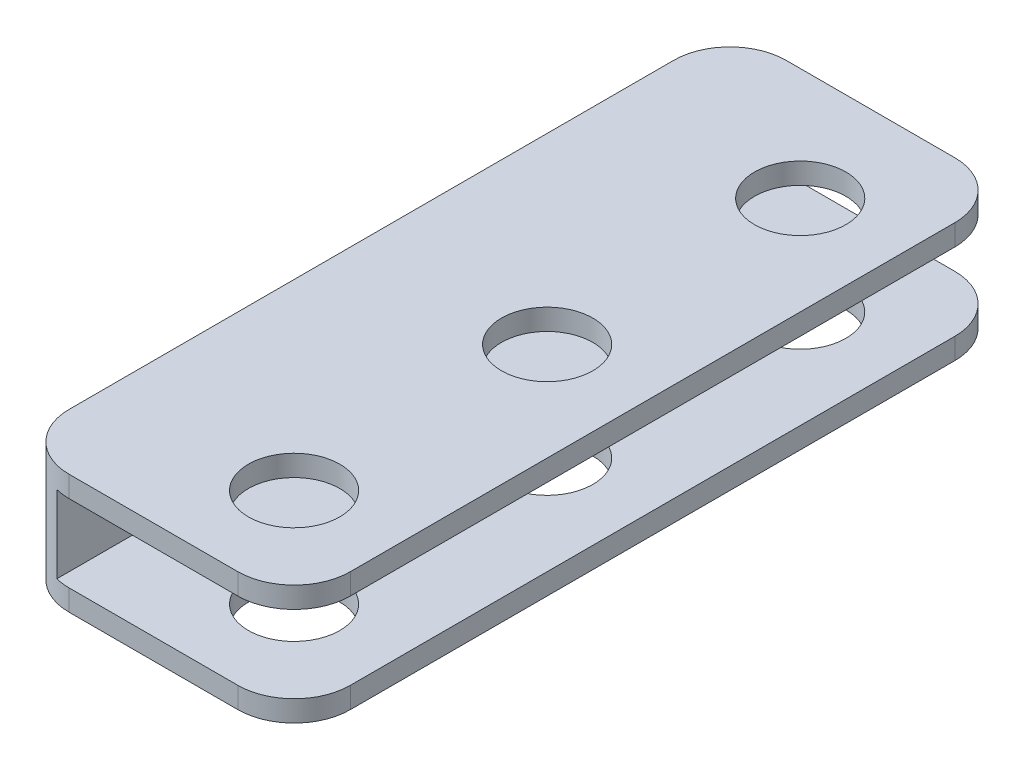
ISO-10303-21;
HEADER;
FILE_DESCRIPTION(('STEP AP214'),'2;1');
FILE_NAME('part.step','',(''),(''),'','','');
FILE_SCHEMA(('AUTOMOTIVE_DESIGN { 1 0 10303 214 1 1 1 1 }'));
ENDSEC;
DATA;
#1=APPLICATION_CONTEXT('core data for automotive mechanical design processes');
#2=APPLICATION_PROTOCOL_DEFINITION('international standard','automotive_design',2000,#1);
#3=PRODUCT_CONTEXT('',#1,'mechanical');
#4=PRODUCT('Part','Part','',(#3));
#5=PRODUCT_RELATED_PRODUCT_CATEGORY('part','',(#4));
#6=PRODUCT_DEFINITION_FORMATION('','',#4);
#7=PRODUCT_DEFINITION_CONTEXT('part definition',#1,'design');
#8=PRODUCT_DEFINITION('design','',#6,#7);
#9=PRODUCT_DEFINITION_SHAPE('','',#8);
#10=(LENGTH_UNIT() NAMED_UNIT(*) SI_UNIT(.MILLI.,.METRE.));
#11=(NAMED_UNIT(*) PLANE_ANGLE_UNIT() SI_UNIT($,.RADIAN.));
#12=(NAMED_UNIT(*) SI_UNIT($,.STERADIAN.) SOLID_ANGLE_UNIT());
#13=UNCERTAINTY_MEASURE_WITH_UNIT(LENGTH_MEASURE(1.E-05),#10,'distance_accuracy_value','');
#14=(GEOMETRIC_REPRESENTATION_CONTEXT(3) GLOBAL_UNCERTAINTY_ASSIGNED_CONTEXT((#13)) GLOBAL_UNIT_ASSIGNED_CONTEXT((#10,
#11,#12)) REPRESENTATION_CONTEXT('',''));
#15=CARTESIAN_POINT('',(0.,0.,0.));
#16=DIRECTION('',(0.,0.,1.));
#17=DIRECTION('',(1.,0.,0.));
#18=AXIS2_PLACEMENT_3D('',#15,#16,#17);
#19=CARTESIAN_POINT('',(-10.,1.5,-25.5));
#20=DIRECTION('',(0.,0.,1.));
#21=DIRECTION('',(1.,0.,0.));
#22=AXIS2_PLACEMENT_3D('',#19,#20,#21);
#23=PLANE('',#22);
#24=DIRECTION('',(-1.,0.,0.));
#25=VECTOR('',#24,1.);
#26=CARTESIAN_POINT('',(-10.,1.5,-25.5));
#27=LINE('',#26,#25);
#28=CARTESIAN_POINT('',(6.,1.5,-25.5));
#29=VERTEX_POINT('',#28);
#30=CARTESIAN_POINT('',(-6.,1.5,-25.5));
#31=VERTEX_POINT('',#30);
#32=EDGE_CURVE('E340',#29,#31,#27,.T.);
#33=ORIENTED_EDGE('',*,*,#32,.F.);
#34=DIRECTION('',(0.,-1.,0.));
#35=VECTOR('',#34,1.);
#36=CARTESIAN_POINT('',(6.,1.5,-25.5));
#37=LINE('',#36,#35);
#38=CARTESIAN_POINT('',(6.,0.,-25.5));
#39=VERTEX_POINT('',#38);
#40=EDGE_CURVE('E279',#29,#39,#37,.T.);
#41=ORIENTED_EDGE('',*,*,#40,.T.);
#42=DIRECTION('',(-1.,0.,0.));
#43=VECTOR('',#42,1.);
#44=CARTESIAN_POINT('',(-10.,0.,-25.5));
#45=LINE('',#44,#43);
#46=CARTESIAN_POINT('',(-6.,0.,-25.5));
#47=VERTEX_POINT('',#46);
#48=EDGE_CURVE('E187',#39,#47,#45,.T.);
#49=ORIENTED_EDGE('',*,*,#48,.T.);
#50=DIRECTION('',(0.,-1.,0.));
#51=VECTOR('',#50,1.);
#52=CARTESIAN_POINT('',(-6.,1.5,-25.5));
#53=LINE('',#52,#51);
#54=EDGE_CURVE('E272',#47,#31,#53,.F.);
#55=ORIENTED_EDGE('',*,*,#54,.T.);
#56=EDGE_LOOP('',(#33,#41,#49,#55));
#57=FACE_BOUND('',#56,.T.);
#58=ADVANCED_FACE('F43',(#57),#23,.F.);
#59=CARTESIAN_POINT('',(-10.,1.5,25.5));
#60=DIRECTION('',(0.,0.,-1.));
#61=DIRECTION('',(-1.,0.,0.));
#62=AXIS2_PLACEMENT_3D('',#59,#60,#61);
#63=PLANE('',#62);
#64=DIRECTION('',(1.,0.,0.));
#65=VECTOR('',#64,1.);
#66=CARTESIAN_POINT('',(-10.,7.,25.5));
#67=LINE('',#66,#65);
#68=CARTESIAN_POINT('',(-6.,7.,25.5));
#69=VERTEX_POINT('',#68);
#70=CARTESIAN_POINT('',(6.,7.,25.5));
#71=VERTEX_POINT('',#70);
#72=EDGE_CURVE('E329',#69,#71,#67,.T.);
#73=ORIENTED_EDGE('',*,*,#72,.T.);
#74=DIRECTION('',(0.,-1.,0.));
#75=VECTOR('',#74,1.);
#76=CARTESIAN_POINT('',(6.,1.5,25.5));
#77=LINE('',#76,#75);
#78=CARTESIAN_POINT('',(6.,8.5,25.5));
#79=VERTEX_POINT('',#78);
#80=EDGE_CURVE('E223',#71,#79,#77,.F.);
#81=ORIENTED_EDGE('',*,*,#80,.T.);
#82=DIRECTION('',(1.,0.,0.));
#83=VECTOR('',#82,1.);
#84=CARTESIAN_POINT('',(-10.,8.5,25.5));
#85=LINE('',#84,#83);
#86=CARTESIAN_POINT('',(-6.,8.5,25.5));
#87=VERTEX_POINT('',#86);
#88=EDGE_CURVE('E311',#87,#79,#85,.T.);
#89=ORIENTED_EDGE('',*,*,#88,.F.);
#90=DIRECTION('',(0.,-1.,0.));
#91=VECTOR('',#90,1.);
#92=CARTESIAN_POINT('',(-6.,1.5,25.5));
#93=LINE('',#92,#91);
#94=EDGE_CURVE('E219',#87,#69,#93,.T.);
#95=ORIENTED_EDGE('',*,*,#94,.T.);
#96=EDGE_LOOP('',(#73,#81,#89,#95));
#97=FACE_BOUND('',#96,.T.);
#98=ADVANCED_FACE('F355',(#97),#63,.F.);
#99=CARTESIAN_POINT('',(0.,1.5,0.));
#100=DIRECTION('',(0.,-1.,0.));
#101=DIRECTION('',(0.,0.,-1.));
#102=AXIS2_PLACEMENT_3D('',#99,#100,#101);
#103=PLANE('',#102);
#104=CARTESIAN_POINT('',(3.,1.5,-17.5));
#105=DIRECTION('',(0.,-1.,0.));
#106=DIRECTION('',(0.,0.,-1.));
#107=AXIS2_PLACEMENT_3D('',#104,#105,#106);
#108=CIRCLE('',#107,3.25);
#109=CARTESIAN_POINT('',(3.,1.5,-20.75));
#110=VERTEX_POINT('',#109);
#111=EDGE_CURVE('E321',#110,#110,#108,.T.);
#112=ORIENTED_EDGE('',*,*,#111,.T.);
#113=EDGE_LOOP('',(#112));
#114=FACE_BOUND('',#113,.T.);
#115=CARTESIAN_POINT('',(3.00000000000001,1.5,0.5));
#116=DIRECTION('',(0.,-1.,0.));
#117=DIRECTION('',(0.,0.,-1.));
#118=AXIS2_PLACEMENT_3D('',#115,#116,#117);
#119=CIRCLE('',#118,3.25);
#120=CARTESIAN_POINT('',(3.00000000000001,1.5,-2.75));
#121=VERTEX_POINT('',#120);
#122=EDGE_CURVE('E654',#121,#121,#119,.T.);
#123=ORIENTED_EDGE('',*,*,#122,.T.);
#124=EDGE_LOOP('',(#123));
#125=FACE_BOUND('',#124,.T.);
#126=CARTESIAN_POINT('',(3.00000000000001,1.5,18.5));
#127=DIRECTION('',(0.,-1.,0.));
#128=DIRECTION('',(0.,0.,-1.));
#129=AXIS2_PLACEMENT_3D('',#126,#127,#128);
#130=CIRCLE('',#129,3.25);
#131=CARTESIAN_POINT('',(3.00000000000001,1.5,15.25));
#132=VERTEX_POINT('',#131);
#133=EDGE_CURVE('E635',#132,#132,#130,.T.);
#134=ORIENTED_EDGE('',*,*,#133,.T.);
#135=EDGE_LOOP('',(#134));
#136=FACE_BOUND('',#135,.T.);
#137=DIRECTION('',(1.,0.,0.));
#138=VECTOR('',#137,1.);
#139=CARTESIAN_POINT('',(-10.,1.5,25.5));
#140=LINE('',#139,#138);
#141=CARTESIAN_POINT('',(-6.,1.5,25.5));
#142=VERTEX_POINT('',#141);
#143=CARTESIAN_POINT('',(6.,1.5,25.5));
#144=VERTEX_POINT('',#143);
#145=EDGE_CURVE('E199',#142,#144,#140,.T.);
#146=ORIENTED_EDGE('',*,*,#145,.T.);
#147=CARTESIAN_POINT('',(6.,1.5,21.5));
#148=DIRECTION('',(0.,-1.,0.));
#149=DIRECTION('',(0.,0.,-1.));
#150=AXIS2_PLACEMENT_3D('',#147,#148,#149);
#151=CIRCLE('',#150,4.);
#152=CARTESIAN_POINT('',(10.,1.5,21.5));
#153=VERTEX_POINT('',#152);
#154=EDGE_CURVE('E237',#144,#153,#151,.F.);
#155=ORIENTED_EDGE('',*,*,#154,.T.);
#156=DIRECTION('',(0.,0.,-1.));
#157=VECTOR('',#156,1.);
#158=CARTESIAN_POINT('',(10.,1.5,25.5));
#159=LINE('',#158,#157);
#160=CARTESIAN_POINT('',(10.,1.5,-21.5));
#161=VERTEX_POINT('',#160);
#162=EDGE_CURVE('E179',#153,#161,#159,.T.);
#163=ORIENTED_EDGE('',*,*,#162,.T.);
#164=CARTESIAN_POINT('',(6.,1.5,-21.5));
#165=DIRECTION('',(0.,-1.,0.));
#166=DIRECTION('',(0.,0.,-1.));
#167=AXIS2_PLACEMENT_3D('',#164,#165,#166);
#168=CIRCLE('',#167,4.);
#169=EDGE_CURVE('E234',#161,#29,#168,.F.);
#170=ORIENTED_EDGE('',*,*,#169,.T.);
#171=ORIENTED_EDGE('',*,*,#32,.T.);
#172=CARTESIAN_POINT('',(-6.,1.5,-21.5));
#173=DIRECTION('',(0.,-1.,0.));
#174=DIRECTION('',(0.,0.,-1.));
#175=AXIS2_PLACEMENT_3D('',#172,#173,#174);
#176=CIRCLE('',#175,4.);
#177=CARTESIAN_POINT('',(-7.,1.5,-25.3729833462074));
#178=VERTEX_POINT('',#177);
#179=EDGE_CURVE('E228',#31,#178,#176,.F.);
#180=ORIENTED_EDGE('',*,*,#179,.T.);
#181=DIRECTION('',(0.,0.,-1.));
#182=VECTOR('',#181,1.);
#183=CARTESIAN_POINT('',(-7.,1.5,-25.5));
#184=LINE('',#183,#182);
#185=CARTESIAN_POINT('',(-6.99999999999999,1.5,25.3729833462074));
#186=VERTEX_POINT('',#185);
#187=EDGE_CURVE('E196',#186,#178,#184,.T.);
#188=ORIENTED_EDGE('',*,*,#187,.F.);
#189=CARTESIAN_POINT('',(-6.,1.5,21.5));
#190=DIRECTION('',(0.,-1.,0.));
#191=DIRECTION('',(0.,0.,-1.));
#192=AXIS2_PLACEMENT_3D('',#189,#190,#191);
#193=CIRCLE('',#192,4.);
#194=EDGE_CURVE('E231',#186,#142,#193,.F.);
#195=ORIENTED_EDGE('',*,*,#194,.T.);
#196=EDGE_LOOP('',(#146,#155,#163,#170,#171,#180,#188,#195));
#197=FACE_BOUND('',#196,.T.);
#198=ADVANCED_FACE('F349',(#114,#125,#136,#197),#103,.F.);
#199=CARTESIAN_POINT('',(10.,1.5,25.5));
#200=DIRECTION('',(-1.,0.,0.));
#201=DIRECTION('',(0.,0.,1.));
#202=AXIS2_PLACEMENT_3D('',#199,#200,#201);
#203=PLANE('',#202);
#204=ORIENTED_EDGE('',*,*,#162,.F.);
#205=DIRECTION('',(0.,-1.,0.));
#206=VECTOR('',#205,1.);
#207=CARTESIAN_POINT('',(10.,1.5,21.5));
#208=LINE('',#207,#206);
#209=CARTESIAN_POINT('',(10.,0.,21.5));
#210=VERTEX_POINT('',#209);
#211=EDGE_CURVE('E162',#153,#210,#208,.T.);
#212=ORIENTED_EDGE('',*,*,#211,.T.);
#213=DIRECTION('',(0.,0.,-1.));
#214=VECTOR('',#213,1.);
#215=CARTESIAN_POINT('',(10.,0.,25.5));
#216=LINE('',#215,#214);
#217=CARTESIAN_POINT('',(10.,0.,-21.5));
#218=VERTEX_POINT('',#217);
#219=EDGE_CURVE('E176',#210,#218,#216,.T.);
#220=ORIENTED_EDGE('',*,*,#219,.T.);
#221=DIRECTION('',(0.,-1.,0.));
#222=VECTOR('',#221,1.);
#223=CARTESIAN_POINT('',(10.,1.5,-21.5));
#224=LINE('',#223,#222);
#225=EDGE_CURVE('E182',#218,#161,#224,.F.);
#226=ORIENTED_EDGE('',*,*,#225,.T.);
#227=EDGE_LOOP('',(#204,#212,#220,#226));
#228=FACE_BOUND('',#227,.T.);
#229=ADVANCED_FACE('F175',(#228),#203,.F.);
#230=DIRECTION('',(-1.,0.,0.));
#231=VECTOR('',#230,1.);
#232=CARTESIAN_POINT('',(-10.,8.5,-25.5));
#233=LINE('',#232,#231);
#234=CARTESIAN_POINT('',(6.,8.5,-25.5));
#235=VERTEX_POINT('',#234);
#236=CARTESIAN_POINT('',(-6.,8.5,-25.5));
#237=VERTEX_POINT('',#236);
#238=EDGE_CURVE('E326',#235,#237,#233,.T.);
#239=ORIENTED_EDGE('',*,*,#238,.F.);
#240=DIRECTION('',(0.,-1.,0.));
#241=VECTOR('',#240,1.);
#242=CARTESIAN_POINT('',(6.,1.5,-25.5));
#243=LINE('',#242,#241);
#244=CARTESIAN_POINT('',(6.,7.,-25.5));
#245=VERTEX_POINT('',#244);
#246=EDGE_CURVE('E275',#235,#245,#243,.T.);
#247=ORIENTED_EDGE('',*,*,#246,.T.);
#248=DIRECTION('',(-1.,0.,0.));
#249=VECTOR('',#248,1.);
#250=CARTESIAN_POINT('',(-10.,7.,-25.5));
#251=LINE('',#250,#249);
#252=CARTESIAN_POINT('',(-6.,7.,-25.5));
#253=VERTEX_POINT('',#252);
#254=EDGE_CURVE('E312',#245,#253,#251,.T.);
#255=ORIENTED_EDGE('',*,*,#254,.T.);
#256=DIRECTION('',(0.,-1.,0.));
#257=VECTOR('',#256,1.);
#258=CARTESIAN_POINT('',(-6.,1.5,-25.5));
#259=LINE('',#258,#257);
#260=EDGE_CURVE('E59',#253,#237,#259,.F.);
#261=ORIENTED_EDGE('',*,*,#260,.T.);
#262=EDGE_LOOP('',(#239,#247,#255,#261));
#263=FACE_BOUND('',#262,.T.);
#264=ADVANCED_FACE('F363',(#263),#23,.F.);
#265=CARTESIAN_POINT('',(-10.,1.5,25.5));
#266=DIRECTION('',(1.,0.,0.));
#267=DIRECTION('',(0.,0.,-1.));
#268=AXIS2_PLACEMENT_3D('',#265,#266,#267);
#269=PLANE('',#268);
#270=DIRECTION('',(0.,0.,1.));
#271=VECTOR('',#270,1.);
#272=CARTESIAN_POINT('',(-10.,0.,25.5));
#273=LINE('',#272,#271);
#274=CARTESIAN_POINT('',(-10.,0.,-21.5));
#275=VERTEX_POINT('',#274);
#276=CARTESIAN_POINT('',(-10.,0.,21.5));
#277=VERTEX_POINT('',#276);
#278=EDGE_CURVE('E193',#275,#277,#273,.T.);
#279=ORIENTED_EDGE('',*,*,#278,.T.);
#280=DIRECTION('',(0.,-1.,0.));
#281=VECTOR('',#280,1.);
#282=CARTESIAN_POINT('',(-10.,1.5,21.5));
#283=LINE('',#282,#281);
#284=CARTESIAN_POINT('',(-10.,8.5,21.5));
#285=VERTEX_POINT('',#284);
#286=EDGE_CURVE('E11',#277,#285,#283,.F.);
#287=ORIENTED_EDGE('',*,*,#286,.T.);
#288=DIRECTION('',(0.,0.,1.));
#289=VECTOR('',#288,1.);
#290=CARTESIAN_POINT('',(-10.,8.5,-25.5));
#291=LINE('',#290,#289);
#292=CARTESIAN_POINT('',(-10.,8.5,-21.5));
#293=VERTEX_POINT('',#292);
#294=EDGE_CURVE('E297',#293,#285,#291,.T.);
#295=ORIENTED_EDGE('',*,*,#294,.F.);
#296=DIRECTION('',(0.,-1.,0.));
#297=VECTOR('',#296,1.);
#298=CARTESIAN_POINT('',(-10.,1.5,-21.5));
#299=LINE('',#298,#297);
#300=EDGE_CURVE('E52',#293,#275,#299,.T.);
#301=ORIENTED_EDGE('',*,*,#300,.T.);
#302=EDGE_LOOP('',(#279,#287,#295,#301));
#303=FACE_BOUND('',#302,.T.);
#304=ADVANCED_FACE('F294',(#303),#269,.F.);
#305=DIRECTION('',(1.,0.,0.));
#306=VECTOR('',#305,1.);
#307=CARTESIAN_POINT('',(-10.,0.,25.5));
#308=LINE('',#307,#306);
#309=CARTESIAN_POINT('',(-6.,0.,25.5));
#310=VERTEX_POINT('',#309);
#311=CARTESIAN_POINT('',(6.,0.,25.5));
#312=VERTEX_POINT('',#311);
#313=EDGE_CURVE('E205',#310,#312,#308,.T.);
#314=ORIENTED_EDGE('',*,*,#313,.T.);
#315=DIRECTION('',(0.,-1.,0.));
#316=VECTOR('',#315,1.);
#317=CARTESIAN_POINT('',(6.,1.5,25.5));
#318=LINE('',#317,#316);
#319=EDGE_CURVE('E163',#312,#144,#318,.F.);
#320=ORIENTED_EDGE('',*,*,#319,.T.);
#321=ORIENTED_EDGE('',*,*,#145,.F.);
#322=DIRECTION('',(0.,-1.,0.));
#323=VECTOR('',#322,1.);
#324=CARTESIAN_POINT('',(-6.,1.5,25.5));
#325=LINE('',#324,#323);
#326=EDGE_CURVE('E169',#142,#310,#325,.T.);
#327=ORIENTED_EDGE('',*,*,#326,.T.);
#328=EDGE_LOOP('',(#314,#320,#321,#327));
#329=FACE_BOUND('',#328,.T.);
#330=ADVANCED_FACE('F352',(#329),#63,.F.);
#331=CARTESIAN_POINT('',(0.,0.,0.));
#332=DIRECTION('',(0.,-1.,0.));
#333=DIRECTION('',(0.,0.,-1.));
#334=AXIS2_PLACEMENT_3D('',#331,#332,#333);
#335=PLANE('',#334);
#336=CARTESIAN_POINT('',(3.,0.,-17.5));
#337=DIRECTION('',(0.,-1.,0.));
#338=DIRECTION('',(0.,0.,-1.));
#339=AXIS2_PLACEMENT_3D('',#336,#337,#338);
#340=CIRCLE('',#339,3.25);
#341=CARTESIAN_POINT('',(3.,0.,-20.75));
#342=VERTEX_POINT('',#341);
#343=EDGE_CURVE('E661',#342,#342,#340,.T.);
#344=ORIENTED_EDGE('',*,*,#343,.F.);
#345=EDGE_LOOP('',(#344));
#346=FACE_BOUND('',#345,.T.);
#347=CARTESIAN_POINT('',(3.00000000000001,0.,0.5));
#348=DIRECTION('',(0.,-1.,0.));
#349=DIRECTION('',(0.,0.,-1.));
#350=AXIS2_PLACEMENT_3D('',#347,#348,#349);
#351=CIRCLE('',#350,3.25);
#352=CARTESIAN_POINT('',(3.00000000000001,0.,-2.75));
#353=VERTEX_POINT('',#352);
#354=EDGE_CURVE('E650',#353,#353,#351,.T.);
#355=ORIENTED_EDGE('',*,*,#354,.F.);
#356=EDGE_LOOP('',(#355));
#357=FACE_BOUND('',#356,.T.);
#358=CARTESIAN_POINT('',(3.00000000000001,0.,18.5));
#359=DIRECTION('',(0.,-1.,0.));
#360=DIRECTION('',(0.,0.,-1.));
#361=AXIS2_PLACEMENT_3D('',#358,#359,#360);
#362=CIRCLE('',#361,3.25);
#363=CARTESIAN_POINT('',(3.00000000000001,0.,15.25));
#364=VERTEX_POINT('',#363);
#365=EDGE_CURVE('E629',#364,#364,#362,.T.);
#366=ORIENTED_EDGE('',*,*,#365,.F.);
#367=EDGE_LOOP('',(#366));
#368=FACE_BOUND('',#367,.T.);
#369=ORIENTED_EDGE('',*,*,#219,.F.);
#370=CARTESIAN_POINT('',(6.,0.,21.5));
#371=DIRECTION('',(0.,-1.,0.));
#372=DIRECTION('',(0.,0.,-1.));
#373=AXIS2_PLACEMENT_3D('',#370,#371,#372);
#374=CIRCLE('',#373,4.);
#375=EDGE_CURVE('E158',#210,#312,#374,.T.);
#376=ORIENTED_EDGE('',*,*,#375,.T.);
#377=ORIENTED_EDGE('',*,*,#313,.F.);
#378=CARTESIAN_POINT('',(-6.,0.,21.5));
#379=DIRECTION('',(0.,-1.,0.));
#380=DIRECTION('',(0.,0.,-1.));
#381=AXIS2_PLACEMENT_3D('',#378,#379,#380);
#382=CIRCLE('',#381,4.);
#383=EDGE_CURVE('E212',#310,#277,#382,.T.);
#384=ORIENTED_EDGE('',*,*,#383,.T.);
#385=ORIENTED_EDGE('',*,*,#278,.F.);
#386=CARTESIAN_POINT('',(-6.,0.,-21.5));
#387=DIRECTION('',(0.,-1.,0.));
#388=DIRECTION('',(0.,0.,-1.));
#389=AXIS2_PLACEMENT_3D('',#386,#387,#388);
#390=CIRCLE('',#389,4.);
#391=EDGE_CURVE('E181',#275,#47,#390,.T.);
#392=ORIENTED_EDGE('',*,*,#391,.T.);
#393=ORIENTED_EDGE('',*,*,#48,.F.);
#394=CARTESIAN_POINT('',(6.,0.,-21.5));
#395=DIRECTION('',(0.,-1.,0.));
#396=DIRECTION('',(0.,0.,-1.));
#397=AXIS2_PLACEMENT_3D('',#394,#395,#396);
#398=CIRCLE('',#397,4.);
#399=EDGE_CURVE('E170',#39,#218,#398,.T.);
#400=ORIENTED_EDGE('',*,*,#399,.T.);
#401=EDGE_LOOP('',(#369,#376,#377,#384,#385,#392,#393,#400));
#402=FACE_BOUND('',#401,.T.);
#403=ADVANCED_FACE('F184',(#346,#357,#368,#402),#335,.T.);
#404=CARTESIAN_POINT('',(-7.,7.,-25.5));
#405=DIRECTION('',(-1.,0.,0.));
#406=DIRECTION('',(0.,0.,1.));
#407=AXIS2_PLACEMENT_3D('',#404,#405,#406);
#408=PLANE('',#407);
#409=DIRECTION('',(0.,0.,-1.));
#410=VECTOR('',#409,1.);
#411=CARTESIAN_POINT('',(-7.,7.,-25.5));
#412=LINE('',#411,#410);
#413=CARTESIAN_POINT('',(-6.99999999999999,7.,25.3729833462074));
#414=VERTEX_POINT('',#413);
#415=CARTESIAN_POINT('',(-7.,7.,-25.3729833462074));
#416=VERTEX_POINT('',#415);
#417=EDGE_CURVE('E188',#414,#416,#412,.T.);
#418=ORIENTED_EDGE('',*,*,#417,.F.);
#419=DIRECTION('',(0.,-1.,0.));
#420=VECTOR('',#419,1.);
#421=CARTESIAN_POINT('',(-6.99999999999999,7.,25.3729833462074));
#422=LINE('',#421,#420);
#423=EDGE_CURVE('E286',#414,#186,#422,.T.);
#424=ORIENTED_EDGE('',*,*,#423,.T.);
#425=ORIENTED_EDGE('',*,*,#187,.T.);
#426=DIRECTION('',(0.,-1.,0.));
#427=VECTOR('',#426,1.);
#428=CARTESIAN_POINT('',(-7.,1.5,-25.3729833462074));
#429=LINE('',#428,#427);
#430=EDGE_CURVE('E283',#178,#416,#429,.F.);
#431=ORIENTED_EDGE('',*,*,#430,.T.);
#432=EDGE_LOOP('',(#418,#424,#425,#431));
#433=FACE_BOUND('',#432,.T.);
#434=ADVANCED_FACE('F360',(#433),#408,.F.);
#435=CARTESIAN_POINT('',(0.,7.,0.));
#436=DIRECTION('',(0.,1.,0.));
#437=DIRECTION('',(0.,0.,1.));
#438=AXIS2_PLACEMENT_3D('',#435,#436,#437);
#439=PLANE('',#438);
#440=CARTESIAN_POINT('',(3.,7.,-17.5));
#441=DIRECTION('',(0.,1.,0.));
#442=DIRECTION('',(0.,0.,1.));
#443=AXIS2_PLACEMENT_3D('',#440,#441,#442);
#444=CIRCLE('',#443,3.25);
#445=CARTESIAN_POINT('',(3.,7.,-14.25));
#446=VERTEX_POINT('',#445);
#447=EDGE_CURVE('E658',#446,#446,#444,.T.);
#448=ORIENTED_EDGE('',*,*,#447,.T.);
#449=EDGE_LOOP('',(#448));
#450=FACE_BOUND('',#449,.T.);
#451=CARTESIAN_POINT('',(3.00000000000001,7.,0.5));
#452=DIRECTION('',(0.,1.,0.));
#453=DIRECTION('',(0.,0.,1.));
#454=AXIS2_PLACEMENT_3D('',#451,#452,#453);
#455=CIRCLE('',#454,3.25);
#456=CARTESIAN_POINT('',(3.00000000000001,7.,3.75));
#457=VERTEX_POINT('',#456);
#458=EDGE_CURVE('E646',#457,#457,#455,.T.);
#459=ORIENTED_EDGE('',*,*,#458,.T.);
#460=EDGE_LOOP('',(#459));
#461=FACE_BOUND('',#460,.T.);
#462=CARTESIAN_POINT('',(3.00000000000001,7.,18.5));
#463=DIRECTION('',(0.,1.,0.));
#464=DIRECTION('',(0.,0.,1.));
#465=AXIS2_PLACEMENT_3D('',#462,#463,#464);
#466=CIRCLE('',#465,3.25);
#467=CARTESIAN_POINT('',(3.00000000000001,7.,21.75));
#468=VERTEX_POINT('',#467);
#469=EDGE_CURVE('E626',#468,#468,#466,.T.);
#470=ORIENTED_EDGE('',*,*,#469,.T.);
#471=EDGE_LOOP('',(#470));
#472=FACE_BOUND('',#471,.T.);
#473=DIRECTION('',(0.,0.,-1.));
#474=VECTOR('',#473,1.);
#475=CARTESIAN_POINT('',(10.,7.,-25.5));
#476=LINE('',#475,#474);
#477=CARTESIAN_POINT('',(10.,7.,21.5));
#478=VERTEX_POINT('',#477);
#479=CARTESIAN_POINT('',(10.,7.,-21.5));
#480=VERTEX_POINT('',#479);
#481=EDGE_CURVE('E318',#478,#480,#476,.T.);
#482=ORIENTED_EDGE('',*,*,#481,.F.);
#483=CARTESIAN_POINT('',(6.,7.,21.5));
#484=DIRECTION('',(0.,1.,0.));
#485=DIRECTION('',(0.,0.,1.));
#486=AXIS2_PLACEMENT_3D('',#483,#484,#485);
#487=CIRCLE('',#486,4.);
#488=EDGE_CURVE('E256',#478,#71,#487,.F.);
#489=ORIENTED_EDGE('',*,*,#488,.T.);
#490=ORIENTED_EDGE('',*,*,#72,.F.);
#491=CARTESIAN_POINT('',(-6.,7.,21.5));
#492=DIRECTION('',(0.,1.,0.));
#493=DIRECTION('',(0.,0.,1.));
#494=AXIS2_PLACEMENT_3D('',#491,#492,#493);
#495=CIRCLE('',#494,4.);
#496=EDGE_CURVE('E250',#69,#414,#495,.F.);
#497=ORIENTED_EDGE('',*,*,#496,.T.);
#498=ORIENTED_EDGE('',*,*,#417,.T.);
#499=CARTESIAN_POINT('',(-6.,7.,-21.5));
#500=DIRECTION('',(0.,1.,0.));
#501=DIRECTION('',(0.,0.,1.));
#502=AXIS2_PLACEMENT_3D('',#499,#500,#501);
#503=CIRCLE('',#502,4.);
#504=EDGE_CURVE('E247',#416,#253,#503,.F.);
#505=ORIENTED_EDGE('',*,*,#504,.T.);
#506=ORIENTED_EDGE('',*,*,#254,.F.);
#507=CARTESIAN_POINT('',(6.,7.,-21.5));
#508=DIRECTION('',(0.,1.,0.));
#509=DIRECTION('',(0.,0.,1.));
#510=AXIS2_PLACEMENT_3D('',#507,#508,#509);
#511=CIRCLE('',#510,4.);
#512=EDGE_CURVE('E253',#245,#480,#511,.F.);
#513=ORIENTED_EDGE('',*,*,#512,.T.);
#514=EDGE_LOOP('',(#482,#489,#490,#497,#498,#505,#506,#513));
#515=FACE_BOUND('',#514,.T.);
#516=ADVANCED_FACE('F384',(#450,#461,#472,#515),#439,.F.);
#517=CARTESIAN_POINT('',(10.,8.5,-25.5));
#518=DIRECTION('',(-1.,0.,0.));
#519=DIRECTION('',(0.,0.,1.));
#520=AXIS2_PLACEMENT_3D('',#517,#518,#519);
#521=PLANE('',#520);
#522=DIRECTION('',(0.,0.,-1.));
#523=VECTOR('',#522,1.);
#524=CARTESIAN_POINT('',(10.,8.5,-25.5));
#525=LINE('',#524,#523);
#526=CARTESIAN_POINT('',(10.,8.5,21.5));
#527=VERTEX_POINT('',#526);
#528=CARTESIAN_POINT('',(10.,8.5,-21.5));
#529=VERTEX_POINT('',#528);
#530=EDGE_CURVE('E316',#527,#529,#525,.T.);
#531=ORIENTED_EDGE('',*,*,#530,.F.);
#532=DIRECTION('',(0.,-1.,0.));
#533=VECTOR('',#532,1.);
#534=CARTESIAN_POINT('',(10.,8.5,21.5));
#535=LINE('',#534,#533);
#536=EDGE_CURVE('E243',#527,#478,#535,.T.);
#537=ORIENTED_EDGE('',*,*,#536,.T.);
#538=ORIENTED_EDGE('',*,*,#481,.T.);
#539=DIRECTION('',(0.,-1.,0.));
#540=VECTOR('',#539,1.);
#541=CARTESIAN_POINT('',(10.,8.5,-21.5));
#542=LINE('',#541,#540);
#543=EDGE_CURVE('E240',#480,#529,#542,.F.);
#544=ORIENTED_EDGE('',*,*,#543,.T.);
#545=EDGE_LOOP('',(#531,#537,#538,#544));
#546=FACE_BOUND('',#545,.T.);
#547=ADVANCED_FACE('F387',(#546),#521,.F.);
#548=CARTESIAN_POINT('',(0.,8.5,0.));
#549=DIRECTION('',(0.,1.,0.));
#550=DIRECTION('',(0.,0.,1.));
#551=AXIS2_PLACEMENT_3D('',#548,#549,#550);
#552=PLANE('',#551);
#553=CARTESIAN_POINT('',(3.,8.5,-17.5));
#554=DIRECTION('',(0.,1.,0.));
#555=DIRECTION('',(0.,0.,1.));
#556=AXIS2_PLACEMENT_3D('',#553,#554,#555);
#557=CIRCLE('',#556,3.25);
#558=CARTESIAN_POINT('',(3.,8.5,-14.25));
#559=VERTEX_POINT('',#558);
#560=EDGE_CURVE('E630',#559,#559,#557,.T.);
#561=ORIENTED_EDGE('',*,*,#560,.F.);
#562=EDGE_LOOP('',(#561));
#563=FACE_BOUND('',#562,.T.);
#564=CARTESIAN_POINT('',(3.00000000000001,8.5,0.5));
#565=DIRECTION('',(0.,1.,0.));
#566=DIRECTION('',(0.,0.,1.));
#567=AXIS2_PLACEMENT_3D('',#564,#565,#566);
#568=CIRCLE('',#567,3.25);
#569=CARTESIAN_POINT('',(3.00000000000001,8.5,3.75));
#570=VERTEX_POINT('',#569);
#571=EDGE_CURVE('E638',#570,#570,#568,.T.);
#572=ORIENTED_EDGE('',*,*,#571,.F.);
#573=EDGE_LOOP('',(#572));
#574=FACE_BOUND('',#573,.T.);
#575=CARTESIAN_POINT('',(3.00000000000001,8.5,18.5));
#576=DIRECTION('',(0.,1.,0.));
#577=DIRECTION('',(0.,0.,1.));
#578=AXIS2_PLACEMENT_3D('',#575,#576,#577);
#579=CIRCLE('',#578,3.25);
#580=CARTESIAN_POINT('',(3.00000000000001,8.5,21.75));
#581=VERTEX_POINT('',#580);
#582=EDGE_CURVE('E623',#581,#581,#579,.T.);
#583=ORIENTED_EDGE('',*,*,#582,.F.);
#584=EDGE_LOOP('',(#583));
#585=FACE_BOUND('',#584,.T.);
#586=ORIENTED_EDGE('',*,*,#88,.T.);
#587=CARTESIAN_POINT('',(6.,8.5,21.5));
#588=DIRECTION('',(0.,1.,0.));
#589=DIRECTION('',(0.,0.,1.));
#590=AXIS2_PLACEMENT_3D('',#587,#588,#589);
#591=CIRCLE('',#590,4.);
#592=EDGE_CURVE('E267',#79,#527,#591,.T.);
#593=ORIENTED_EDGE('',*,*,#592,.T.);
#594=ORIENTED_EDGE('',*,*,#530,.T.);
#595=CARTESIAN_POINT('',(6.,8.5,-21.5));
#596=DIRECTION('',(0.,1.,0.));
#597=DIRECTION('',(0.,0.,1.));
#598=AXIS2_PLACEMENT_3D('',#595,#596,#597);
#599=CIRCLE('',#598,4.);
#600=EDGE_CURVE('E66',#529,#235,#599,.T.);
#601=ORIENTED_EDGE('',*,*,#600,.T.);
#602=ORIENTED_EDGE('',*,*,#238,.T.);
#603=CARTESIAN_POINT('',(-6.,8.5,-21.5));
#604=DIRECTION('',(0.,1.,0.));
#605=DIRECTION('',(0.,0.,1.));
#606=AXIS2_PLACEMENT_3D('',#603,#604,#605);
#607=CIRCLE('',#606,4.);
#608=EDGE_CURVE('E259',#237,#293,#607,.T.);
#609=ORIENTED_EDGE('',*,*,#608,.T.);
#610=ORIENTED_EDGE('',*,*,#294,.T.);
#611=CARTESIAN_POINT('',(-6.,8.5,21.5));
#612=DIRECTION('',(0.,1.,0.));
#613=DIRECTION('',(0.,0.,1.));
#614=AXIS2_PLACEMENT_3D('',#611,#612,#613);
#615=CIRCLE('',#614,4.);
#616=EDGE_CURVE('E262',#285,#87,#615,.T.);
#617=ORIENTED_EDGE('',*,*,#616,.T.);
#618=EDGE_LOOP('',(#586,#593,#594,#601,#602,#609,#610,#617));
#619=FACE_BOUND('',#618,.T.);
#620=ADVANCED_FACE('F308',(#563,#574,#585,#619),#552,.T.);
#621=CARTESIAN_POINT('',(3.00000000000001,-6.5,18.5));
#622=DIRECTION('',(0.,1.,0.));
#623=DIRECTION('',(0.,0.,1.));
#624=AXIS2_PLACEMENT_3D('',#621,#622,#623);
#625=CYLINDRICAL_SURFACE('',#624,3.25);
#626=ORIENTED_EDGE('',*,*,#582,.T.);
#627=EDGE_LOOP('',(#626));
#628=FACE_BOUND('',#627,.T.);
#629=ORIENTED_EDGE('',*,*,#469,.F.);
#630=EDGE_LOOP('',(#629));
#631=FACE_BOUND('',#630,.T.);
#632=ADVANCED_FACE('F464',(#628,#631),#625,.F.);
#633=CARTESIAN_POINT('',(3.00000000000001,-6.5,0.5));
#634=DIRECTION('',(0.,1.,0.));
#635=DIRECTION('',(0.,0.,1.));
#636=AXIS2_PLACEMENT_3D('',#633,#634,#635);
#637=CYLINDRICAL_SURFACE('',#636,3.25);
#638=ORIENTED_EDGE('',*,*,#571,.T.);
#639=EDGE_LOOP('',(#638));
#640=FACE_BOUND('',#639,.T.);
#641=ORIENTED_EDGE('',*,*,#458,.F.);
#642=EDGE_LOOP('',(#641));
#643=FACE_BOUND('',#642,.T.);
#644=ADVANCED_FACE('F571',(#640,#643),#637,.F.);
#645=CARTESIAN_POINT('',(3.,-6.5,-17.5));
#646=DIRECTION('',(0.,1.,0.));
#647=DIRECTION('',(0.,0.,1.));
#648=AXIS2_PLACEMENT_3D('',#645,#646,#647);
#649=CYLINDRICAL_SURFACE('',#648,3.25);
#650=ORIENTED_EDGE('',*,*,#560,.T.);
#651=EDGE_LOOP('',(#650));
#652=FACE_BOUND('',#651,.T.);
#653=ORIENTED_EDGE('',*,*,#447,.F.);
#654=EDGE_LOOP('',(#653));
#655=FACE_BOUND('',#654,.T.);
#656=ADVANCED_FACE('F559',(#652,#655),#649,.F.);
#657=ORIENTED_EDGE('',*,*,#365,.T.);
#658=EDGE_LOOP('',(#657));
#659=FACE_BOUND('',#658,.T.);
#660=ORIENTED_EDGE('',*,*,#133,.F.);
#661=EDGE_LOOP('',(#660));
#662=FACE_BOUND('',#661,.T.);
#663=ADVANCED_FACE('F568',(#659,#662),#625,.F.);
#664=ORIENTED_EDGE('',*,*,#354,.T.);
#665=EDGE_LOOP('',(#664));
#666=FACE_BOUND('',#665,.T.);
#667=ORIENTED_EDGE('',*,*,#122,.F.);
#668=EDGE_LOOP('',(#667));
#669=FACE_BOUND('',#668,.T.);
#670=ADVANCED_FACE('F556',(#666,#669),#637,.F.);
#671=ORIENTED_EDGE('',*,*,#343,.T.);
#672=EDGE_LOOP('',(#671));
#673=FACE_BOUND('',#672,.T.);
#674=ORIENTED_EDGE('',*,*,#111,.F.);
#675=EDGE_LOOP('',(#674));
#676=FACE_BOUND('',#675,.T.);
#677=ADVANCED_FACE('F453',(#673,#676),#649,.F.);
#678=CARTESIAN_POINT('',(6.,1.5,21.5));
#679=DIRECTION('',(0.,-1.,0.));
#680=DIRECTION('',(0.,0.,-1.));
#681=AXIS2_PLACEMENT_3D('',#678,#679,#680);
#682=CYLINDRICAL_SURFACE('',#681,4.);
#683=ORIENTED_EDGE('',*,*,#154,.F.);
#684=ORIENTED_EDGE('',*,*,#319,.F.);
#685=ORIENTED_EDGE('',*,*,#375,.F.);
#686=ORIENTED_EDGE('',*,*,#211,.F.);
#687=EDGE_LOOP('',(#683,#684,#685,#686));
#688=FACE_BOUND('',#687,.T.);
#689=ADVANCED_FACE('F161',(#688),#682,.T.);
#690=CARTESIAN_POINT('',(6.,8.5,21.5));
#691=DIRECTION('',(0.,-1.,0.));
#692=DIRECTION('',(0.,0.,-1.));
#693=AXIS2_PLACEMENT_3D('',#690,#691,#692);
#694=CYLINDRICAL_SURFACE('',#693,4.);
#695=ORIENTED_EDGE('',*,*,#592,.F.);
#696=ORIENTED_EDGE('',*,*,#80,.F.);
#697=ORIENTED_EDGE('',*,*,#488,.F.);
#698=ORIENTED_EDGE('',*,*,#536,.F.);
#699=EDGE_LOOP('',(#695,#696,#697,#698));
#700=FACE_BOUND('',#699,.T.);
#701=ADVANCED_FACE('F391',(#700),#694,.T.);
#702=CARTESIAN_POINT('',(6.,1.5,-21.5));
#703=DIRECTION('',(0.,-1.,0.));
#704=DIRECTION('',(0.,0.,-1.));
#705=AXIS2_PLACEMENT_3D('',#702,#703,#704);
#706=CYLINDRICAL_SURFACE('',#705,4.);
#707=ORIENTED_EDGE('',*,*,#169,.F.);
#708=ORIENTED_EDGE('',*,*,#225,.F.);
#709=ORIENTED_EDGE('',*,*,#399,.F.);
#710=ORIENTED_EDGE('',*,*,#40,.F.);
#711=EDGE_LOOP('',(#707,#708,#709,#710));
#712=FACE_BOUND('',#711,.T.);
#713=ADVANCED_FACE('F403',(#712),#706,.T.);
#714=CARTESIAN_POINT('',(6.,1.5,-21.5));
#715=DIRECTION('',(0.,-1.,0.));
#716=DIRECTION('',(0.,0.,-1.));
#717=AXIS2_PLACEMENT_3D('',#714,#715,#716);
#718=CYLINDRICAL_SURFACE('',#717,4.);
#719=ORIENTED_EDGE('',*,*,#600,.F.);
#720=ORIENTED_EDGE('',*,*,#543,.F.);
#721=ORIENTED_EDGE('',*,*,#512,.F.);
#722=ORIENTED_EDGE('',*,*,#246,.F.);
#723=EDGE_LOOP('',(#719,#720,#721,#722));
#724=FACE_BOUND('',#723,.T.);
#725=ADVANCED_FACE('F380',(#724),#718,.T.);
#726=CARTESIAN_POINT('',(-6.,1.5,21.5));
#727=DIRECTION('',(0.,-1.,0.));
#728=DIRECTION('',(0.,0.,-1.));
#729=AXIS2_PLACEMENT_3D('',#726,#727,#728);
#730=CYLINDRICAL_SURFACE('',#729,4.);
#731=ORIENTED_EDGE('',*,*,#616,.F.);
#732=ORIENTED_EDGE('',*,*,#286,.F.);
#733=ORIENTED_EDGE('',*,*,#383,.F.);
#734=ORIENTED_EDGE('',*,*,#326,.F.);
#735=ORIENTED_EDGE('',*,*,#194,.F.);
#736=ORIENTED_EDGE('',*,*,#423,.F.);
#737=ORIENTED_EDGE('',*,*,#496,.F.);
#738=ORIENTED_EDGE('',*,*,#94,.F.);
#739=EDGE_LOOP('',(#731,#732,#733,#734,#735,#736,#737,#738));
#740=FACE_BOUND('',#739,.T.);
#741=ADVANCED_FACE('F304',(#740),#730,.T.);
#742=CARTESIAN_POINT('',(-6.,1.5,-21.5));
#743=DIRECTION('',(0.,-1.,0.));
#744=DIRECTION('',(0.,0.,-1.));
#745=AXIS2_PLACEMENT_3D('',#742,#743,#744);
#746=CYLINDRICAL_SURFACE('',#745,4.);
#747=ORIENTED_EDGE('',*,*,#179,.F.);
#748=ORIENTED_EDGE('',*,*,#54,.F.);
#749=ORIENTED_EDGE('',*,*,#391,.F.);
#750=ORIENTED_EDGE('',*,*,#300,.F.);
#751=ORIENTED_EDGE('',*,*,#608,.F.);
#752=ORIENTED_EDGE('',*,*,#260,.F.);
#753=ORIENTED_EDGE('',*,*,#504,.F.);
#754=ORIENTED_EDGE('',*,*,#430,.F.);
#755=EDGE_LOOP('',(#747,#748,#749,#750,#751,#752,#753,#754));
#756=FACE_BOUND('',#755,.T.);
#757=ADVANCED_FACE('F45',(#756),#746,.T.);
#758=CLOSED_SHELL('',(#58,#98,#198,#229,#264,#304,#330,#403,#434,#516,#547,#620,#632,#644,#656,
#663,#670,#677,#689,#701,#713,#725,#741,#757));
#759=MANIFOLD_SOLID_BREP('B2',#758);
#760=ADVANCED_BREP_SHAPE_REPRESENTATION('',(#18,#759),#14);
#761=SHAPE_DEFINITION_REPRESENTATION(#9,#760);
ENDSEC;
END-ISO-10303-21;
